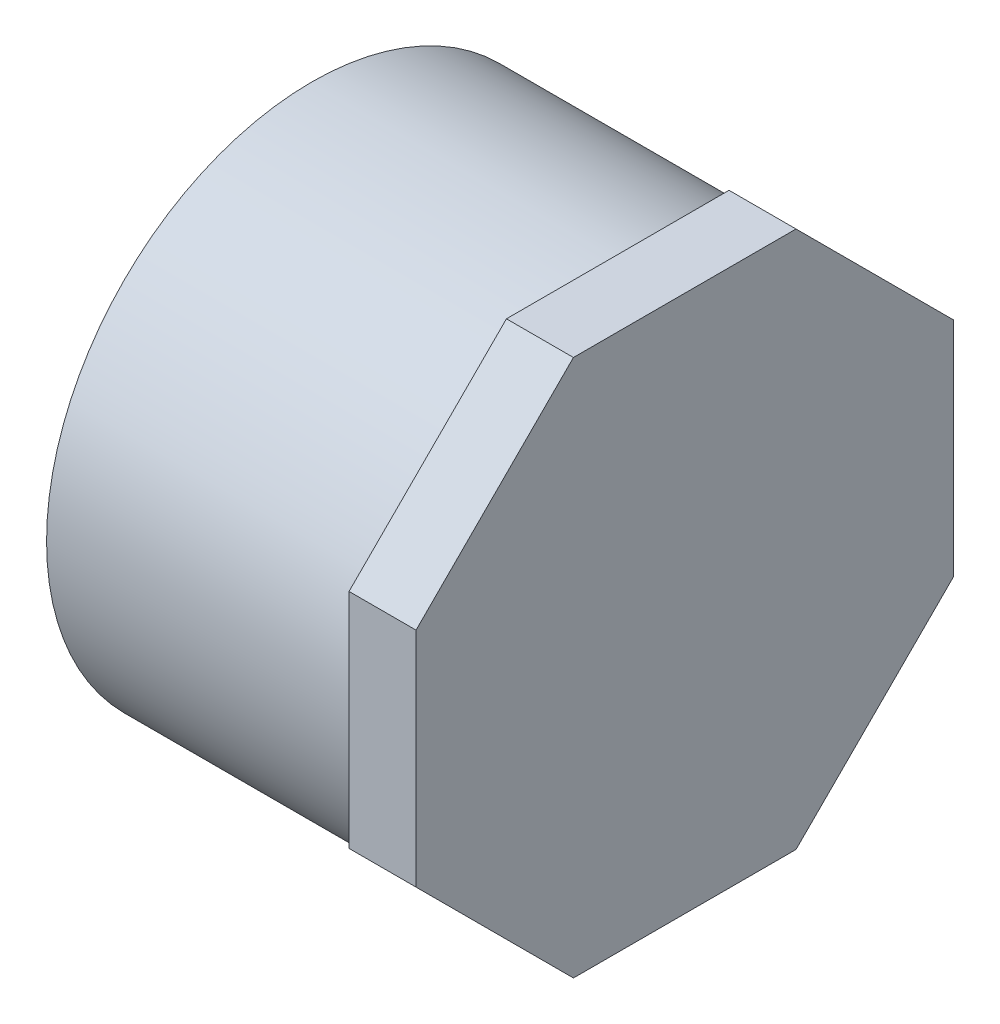
ISO-10303-21;
HEADER;
FILE_DESCRIPTION(('STEP AP214'),'2;1');
FILE_NAME('part.step','',(''),(''),'','','');
FILE_SCHEMA(('AUTOMOTIVE_DESIGN { 1 0 10303 214 1 1 1 1 }'));
ENDSEC;
DATA;
#1=APPLICATION_CONTEXT('core data for automotive mechanical design processes');
#2=APPLICATION_PROTOCOL_DEFINITION('international standard','automotive_design',2000,#1);
#3=PRODUCT_CONTEXT('',#1,'mechanical');
#4=PRODUCT('Part','Part','',(#3));
#5=PRODUCT_RELATED_PRODUCT_CATEGORY('part','',(#4));
#6=PRODUCT_DEFINITION_FORMATION('','',#4);
#7=PRODUCT_DEFINITION_CONTEXT('part definition',#1,'design');
#8=PRODUCT_DEFINITION('design','',#6,#7);
#9=PRODUCT_DEFINITION_SHAPE('','',#8);
#10=(LENGTH_UNIT() NAMED_UNIT(*) SI_UNIT(.MILLI.,.METRE.));
#11=(NAMED_UNIT(*) PLANE_ANGLE_UNIT() SI_UNIT($,.RADIAN.));
#12=(NAMED_UNIT(*) SI_UNIT($,.STERADIAN.) SOLID_ANGLE_UNIT());
#13=UNCERTAINTY_MEASURE_WITH_UNIT(LENGTH_MEASURE(1.E-05),#10,'distance_accuracy_value','');
#14=(GEOMETRIC_REPRESENTATION_CONTEXT(3) GLOBAL_UNCERTAINTY_ASSIGNED_CONTEXT((#13)) GLOBAL_UNIT_ASSIGNED_CONTEXT((#10,
#11,#12)) REPRESENTATION_CONTEXT('',''));
#15=CARTESIAN_POINT('',(0.,0.,0.));
#16=DIRECTION('',(0.,0.,1.));
#17=DIRECTION('',(1.,0.,0.));
#18=AXIS2_PLACEMENT_3D('',#15,#16,#17);
#19=CARTESIAN_POINT('',(-21.209,0.,0.));
#20=DIRECTION('',(-1.,0.,0.));
#21=DIRECTION('',(0.,0.,1.));
#22=AXIS2_PLACEMENT_3D('',#19,#20,#21);
#23=CYLINDRICAL_SURFACE('',#22,30.1625);
#24=CARTESIAN_POINT('',(-21.209,0.,0.));
#25=DIRECTION('',(-1.,0.,0.));
#26=DIRECTION('',(0.,0.,1.));
#27=AXIS2_PLACEMENT_3D('',#24,#25,#26);
#28=CIRCLE('',#27,30.1625);
#29=CARTESIAN_POINT('',(-21.209,0.,30.1625));
#30=VERTEX_POINT('',#29);
#31=EDGE_CURVE('E13',#30,#30,#28,.T.);
#32=ORIENTED_EDGE('',*,*,#31,.F.);
#33=EDGE_LOOP('',(#32));
#34=FACE_BOUND('',#33,.T.);
#35=CARTESIAN_POINT('',(13.589,0.,0.));
#36=DIRECTION('',(1.,0.,0.));
#37=DIRECTION('',(0.,0.,-1.));
#38=AXIS2_PLACEMENT_3D('',#35,#36,#37);
#39=CIRCLE('',#38,30.1625);
#40=CARTESIAN_POINT('',(13.589,0.,-30.1625));
#41=VERTEX_POINT('',#40);
#42=EDGE_CURVE('E150',#41,#41,#39,.T.);
#43=ORIENTED_EDGE('',*,*,#42,.F.);
#44=EDGE_LOOP('',(#43));
#45=FACE_BOUND('',#44,.T.);
#46=ADVANCED_FACE('F46',(#34,#45),#23,.T.);
#47=CARTESIAN_POINT('',(-21.209,-26.2509,0.));
#48=DIRECTION('',(-1.,0.,0.));
#49=DIRECTION('',(0.,0.,1.));
#50=AXIS2_PLACEMENT_3D('',#47,#48,#49);
#51=PLANE('',#50);
#52=ORIENTED_EDGE('',*,*,#31,.T.);
#53=EDGE_LOOP('',(#52));
#54=FACE_BOUND('',#53,.T.);
#55=CARTESIAN_POINT('',(-21.209,0.,0.));
#56=DIRECTION('',(-1.,0.,0.));
#57=DIRECTION('',(0.,0.,1.));
#58=AXIS2_PLACEMENT_3D('',#55,#56,#57);
#59=CIRCLE('',#58,26.2509);
#60=CARTESIAN_POINT('',(-21.209,0.,26.2509));
#61=VERTEX_POINT('',#60);
#62=EDGE_CURVE('E171',#61,#61,#59,.T.);
#63=ORIENTED_EDGE('',*,*,#62,.F.);
#64=EDGE_LOOP('',(#63));
#65=FACE_BOUND('',#64,.T.);
#66=ADVANCED_FACE('F48',(#54,#65),#51,.T.);
#67=CARTESIAN_POINT('',(13.589,0.,0.));
#68=DIRECTION('',(-1.,0.,0.));
#69=DIRECTION('',(0.,0.,1.));
#70=AXIS2_PLACEMENT_3D('',#67,#68,#69);
#71=PLANE('',#70);
#72=CARTESIAN_POINT('',(13.589,0.,0.));
#73=DIRECTION('',(-1.,0.,0.));
#74=DIRECTION('',(0.,0.,1.));
#75=AXIS2_PLACEMENT_3D('',#72,#73,#74);
#76=CIRCLE('',#75,26.2509);
#77=CARTESIAN_POINT('',(13.589,0.,26.2509));
#78=VERTEX_POINT('',#77);
#79=EDGE_CURVE('E55',#78,#78,#76,.T.);
#80=ORIENTED_EDGE('',*,*,#79,.T.);
#81=EDGE_LOOP('',(#80));
#82=FACE_BOUND('',#81,.T.);
#83=ADVANCED_FACE('F185',(#82),#71,.T.);
#84=CARTESIAN_POINT('',(-21.209,0.,0.));
#85=DIRECTION('',(-1.,0.,0.));
#86=DIRECTION('',(0.,0.,1.));
#87=AXIS2_PLACEMENT_3D('',#84,#85,#86);
#88=CYLINDRICAL_SURFACE('',#87,26.2509);
#89=ORIENTED_EDGE('',*,*,#62,.T.);
#90=EDGE_LOOP('',(#89));
#91=FACE_BOUND('',#90,.T.);
#92=ORIENTED_EDGE('',*,*,#79,.F.);
#93=EDGE_LOOP('',(#92));
#94=FACE_BOUND('',#93,.T.);
#95=ADVANCED_FACE('F187',(#91,#94),#88,.F.);
#96=CARTESIAN_POINT('',(13.589,30.5593750000001,-12.6581075826453));
#97=DIRECTION('',(0.,1.,0.));
#98=DIRECTION('',(0.,0.,1.));
#99=AXIS2_PLACEMENT_3D('',#96,#97,#98);
#100=PLANE('',#99);
#101=DIRECTION('',(0.,0.,1.));
#102=VECTOR('',#101,1.);
#103=CARTESIAN_POINT('',(21.209,30.5593750000001,-12.6581075826453));
#104=LINE('',#103,#102);
#105=CARTESIAN_POINT('',(21.209,30.5593750000001,-12.6581075826453));
#106=VERTEX_POINT('',#105);
#107=CARTESIAN_POINT('',(21.209,30.5593750000001,12.6581075826453));
#108=VERTEX_POINT('',#107);
#109=EDGE_CURVE('E146',#106,#108,#104,.T.);
#110=ORIENTED_EDGE('',*,*,#109,.F.);
#111=DIRECTION('',(1.,0.,0.));
#112=VECTOR('',#111,1.);
#113=CARTESIAN_POINT('',(13.589,30.5593750000001,-12.6581075826453));
#114=LINE('',#113,#112);
#115=CARTESIAN_POINT('',(13.589,30.5593750000001,-12.6581075826453));
#116=VERTEX_POINT('',#115);
#117=EDGE_CURVE('E63',#116,#106,#114,.T.);
#118=ORIENTED_EDGE('',*,*,#117,.F.);
#119=DIRECTION('',(0.,0.,1.));
#120=VECTOR('',#119,1.);
#121=CARTESIAN_POINT('',(13.589,30.5593750000001,-12.6581075826453));
#122=LINE('',#121,#120);
#123=CARTESIAN_POINT('',(13.589,30.5593750000001,12.6581075826453));
#124=VERTEX_POINT('',#123);
#125=EDGE_CURVE('E168',#116,#124,#122,.T.);
#126=ORIENTED_EDGE('',*,*,#125,.T.);
#127=DIRECTION('',(1.,0.,0.));
#128=VECTOR('',#127,1.);
#129=CARTESIAN_POINT('',(13.589,30.5593750000001,12.6581075826453));
#130=LINE('',#129,#128);
#131=EDGE_CURVE('E104',#124,#108,#130,.T.);
#132=ORIENTED_EDGE('',*,*,#131,.T.);
#133=EDGE_LOOP('',(#110,#118,#126,#132));
#134=FACE_BOUND('',#133,.T.);
#135=ADVANCED_FACE('F189',(#134),#100,.T.);
#136=CARTESIAN_POINT('',(13.589,12.6581075826453,-30.559375));
#137=DIRECTION('',(0.,0.707106781186548,-0.707106781186548));
#138=DIRECTION('',(0.,0.707106781186547,0.707106781186548));
#139=AXIS2_PLACEMENT_3D('',#136,#137,#138);
#140=PLANE('',#139);
#141=DIRECTION('',(0.,0.707106781186548,0.707106781186548));
#142=VECTOR('',#141,1.);
#143=CARTESIAN_POINT('',(21.209,12.6581075826453,-30.559375));
#144=LINE('',#143,#142);
#145=CARTESIAN_POINT('',(21.209,12.6581075826453,-30.559375));
#146=VERTEX_POINT('',#145);
#147=EDGE_CURVE('E165',#146,#106,#144,.T.);
#148=ORIENTED_EDGE('',*,*,#147,.F.);
#149=DIRECTION('',(1.,0.,0.));
#150=VECTOR('',#149,1.);
#151=CARTESIAN_POINT('',(13.589,12.6581075826453,-30.559375));
#152=LINE('',#151,#150);
#153=CARTESIAN_POINT('',(13.589,12.6581075826453,-30.559375));
#154=VERTEX_POINT('',#153);
#155=EDGE_CURVE('E92',#154,#146,#152,.T.);
#156=ORIENTED_EDGE('',*,*,#155,.F.);
#157=DIRECTION('',(0.,0.707106781186548,0.707106781186548));
#158=VECTOR('',#157,1.);
#159=CARTESIAN_POINT('',(13.589,12.6581075826453,-30.559375));
#160=LINE('',#159,#158);
#161=EDGE_CURVE('E136',#154,#116,#160,.T.);
#162=ORIENTED_EDGE('',*,*,#161,.T.);
#163=ORIENTED_EDGE('',*,*,#117,.T.);
#164=EDGE_LOOP('',(#148,#156,#162,#163));
#165=FACE_BOUND('',#164,.T.);
#166=ADVANCED_FACE('F196',(#165),#140,.T.);
#167=CARTESIAN_POINT('',(13.589,-12.6581075826453,-30.559375));
#168=DIRECTION('',(0.,0.,-1.));
#169=DIRECTION('',(-1.,0.,0.));
#170=AXIS2_PLACEMENT_3D('',#167,#168,#169);
#171=PLANE('',#170);
#172=DIRECTION('',(0.,1.,0.));
#173=VECTOR('',#172,1.);
#174=CARTESIAN_POINT('',(21.209,-12.6581075826453,-30.559375));
#175=LINE('',#174,#173);
#176=CARTESIAN_POINT('',(21.209,-12.6581075826453,-30.559375));
#177=VERTEX_POINT('',#176);
#178=EDGE_CURVE('E123',#177,#146,#175,.T.);
#179=ORIENTED_EDGE('',*,*,#178,.F.);
#180=DIRECTION('',(1.,0.,0.));
#181=VECTOR('',#180,1.);
#182=CARTESIAN_POINT('',(13.589,-12.6581075826453,-30.559375));
#183=LINE('',#182,#181);
#184=CARTESIAN_POINT('',(13.589,-12.6581075826453,-30.559375));
#185=VERTEX_POINT('',#184);
#186=EDGE_CURVE('E118',#185,#177,#183,.T.);
#187=ORIENTED_EDGE('',*,*,#186,.F.);
#188=DIRECTION('',(0.,1.,0.));
#189=VECTOR('',#188,1.);
#190=CARTESIAN_POINT('',(13.589,-12.6581075826453,-30.559375));
#191=LINE('',#190,#189);
#192=EDGE_CURVE('E121',#185,#154,#191,.T.);
#193=ORIENTED_EDGE('',*,*,#192,.T.);
#194=ORIENTED_EDGE('',*,*,#155,.T.);
#195=EDGE_LOOP('',(#179,#187,#193,#194));
#196=FACE_BOUND('',#195,.T.);
#197=ADVANCED_FACE('F120',(#196),#171,.T.);
#198=CARTESIAN_POINT('',(13.589,-30.5593749999999,-12.6581075826453));
#199=DIRECTION('',(0.,-0.707106781186548,-0.707106781186548));
#200=DIRECTION('',(0.,0.707106781186548,-0.707106781186548));
#201=AXIS2_PLACEMENT_3D('',#198,#199,#200);
#202=PLANE('',#201);
#203=DIRECTION('',(0.,0.707106781186548,-0.707106781186548));
#204=VECTOR('',#203,1.);
#205=CARTESIAN_POINT('',(21.209,-30.5593749999999,-12.6581075826453));
#206=LINE('',#205,#204);
#207=CARTESIAN_POINT('',(21.209,-30.5593749999999,-12.6581075826453));
#208=VERTEX_POINT('',#207);
#209=EDGE_CURVE('E162',#208,#177,#206,.T.);
#210=ORIENTED_EDGE('',*,*,#209,.F.);
#211=DIRECTION('',(1.,0.,0.));
#212=VECTOR('',#211,1.);
#213=CARTESIAN_POINT('',(13.589,-30.5593749999999,-12.6581075826453));
#214=LINE('',#213,#212);
#215=CARTESIAN_POINT('',(13.589,-30.5593749999999,-12.6581075826453));
#216=VERTEX_POINT('',#215);
#217=EDGE_CURVE('E128',#216,#208,#214,.T.);
#218=ORIENTED_EDGE('',*,*,#217,.F.);
#219=DIRECTION('',(0.,0.707106781186548,-0.707106781186548));
#220=VECTOR('',#219,1.);
#221=CARTESIAN_POINT('',(13.589,-30.5593749999999,-12.6581075826453));
#222=LINE('',#221,#220);
#223=EDGE_CURVE('E134',#216,#185,#222,.T.);
#224=ORIENTED_EDGE('',*,*,#223,.T.);
#225=ORIENTED_EDGE('',*,*,#186,.T.);
#226=EDGE_LOOP('',(#210,#218,#224,#225));
#227=FACE_BOUND('',#226,.T.);
#228=ADVANCED_FACE('F138',(#227),#202,.T.);
#229=CARTESIAN_POINT('',(13.589,-30.5593750000001,12.6581075826453));
#230=DIRECTION('',(0.,-1.,0.));
#231=DIRECTION('',(0.,0.,-1.));
#232=AXIS2_PLACEMENT_3D('',#229,#230,#231);
#233=PLANE('',#232);
#234=DIRECTION('',(0.,0.,-1.));
#235=VECTOR('',#234,1.);
#236=CARTESIAN_POINT('',(21.209,-30.5593750000001,12.6581075826453));
#237=LINE('',#236,#235);
#238=CARTESIAN_POINT('',(21.209,-30.5593750000001,12.6581075826453));
#239=VERTEX_POINT('',#238);
#240=EDGE_CURVE('E159',#239,#208,#237,.T.);
#241=ORIENTED_EDGE('',*,*,#240,.F.);
#242=DIRECTION('',(1.,0.,0.));
#243=VECTOR('',#242,1.);
#244=CARTESIAN_POINT('',(13.589,-30.5593750000001,12.6581075826453));
#245=LINE('',#244,#243);
#246=CARTESIAN_POINT('',(13.589,-30.5593750000001,12.6581075826453));
#247=VERTEX_POINT('',#246);
#248=EDGE_CURVE('E174',#247,#239,#245,.T.);
#249=ORIENTED_EDGE('',*,*,#248,.F.);
#250=DIRECTION('',(0.,0.,-1.));
#251=VECTOR('',#250,1.);
#252=CARTESIAN_POINT('',(13.589,-30.5593750000001,12.6581075826453));
#253=LINE('',#252,#251);
#254=EDGE_CURVE('E139',#247,#216,#253,.T.);
#255=ORIENTED_EDGE('',*,*,#254,.T.);
#256=ORIENTED_EDGE('',*,*,#217,.T.);
#257=EDGE_LOOP('',(#241,#249,#255,#256));
#258=FACE_BOUND('',#257,.T.);
#259=ADVANCED_FACE('F230',(#258),#233,.T.);
#260=CARTESIAN_POINT('',(13.589,-12.6581075826453,30.559375));
#261=DIRECTION('',(0.,-0.707106781186548,0.707106781186547));
#262=DIRECTION('',(0.,-0.707106781186547,-0.707106781186548));
#263=AXIS2_PLACEMENT_3D('',#260,#261,#262);
#264=PLANE('',#263);
#265=DIRECTION('',(0.,-0.707106781186547,-0.707106781186548));
#266=VECTOR('',#265,1.);
#267=CARTESIAN_POINT('',(21.209,-12.6581075826453,30.559375));
#268=LINE('',#267,#266);
#269=CARTESIAN_POINT('',(21.209,-12.6581075826453,30.559375));
#270=VERTEX_POINT('',#269);
#271=EDGE_CURVE('E156',#270,#239,#268,.T.);
#272=ORIENTED_EDGE('',*,*,#271,.F.);
#273=DIRECTION('',(1.,0.,0.));
#274=VECTOR('',#273,1.);
#275=CARTESIAN_POINT('',(13.589,-12.6581075826453,30.559375));
#276=LINE('',#275,#274);
#277=CARTESIAN_POINT('',(13.589,-12.6581075826453,30.559375));
#278=VERTEX_POINT('',#277);
#279=EDGE_CURVE('E176',#278,#270,#276,.T.);
#280=ORIENTED_EDGE('',*,*,#279,.F.);
#281=DIRECTION('',(0.,-0.707106781186547,-0.707106781186548));
#282=VECTOR('',#281,1.);
#283=CARTESIAN_POINT('',(13.589,-12.6581075826453,30.559375));
#284=LINE('',#283,#282);
#285=EDGE_CURVE('E141',#278,#247,#284,.T.);
#286=ORIENTED_EDGE('',*,*,#285,.T.);
#287=ORIENTED_EDGE('',*,*,#248,.T.);
#288=EDGE_LOOP('',(#272,#280,#286,#287));
#289=FACE_BOUND('',#288,.T.);
#290=ADVANCED_FACE('F226',(#289),#264,.T.);
#291=CARTESIAN_POINT('',(13.589,12.6581075826453,30.559375));
#292=DIRECTION('',(0.,0.,1.));
#293=DIRECTION('',(0.,-1.,0.));
#294=AXIS2_PLACEMENT_3D('',#291,#292,#293);
#295=PLANE('',#294);
#296=DIRECTION('',(0.,-1.,0.));
#297=VECTOR('',#296,1.);
#298=CARTESIAN_POINT('',(21.209,12.6581075826453,30.559375));
#299=LINE('',#298,#297);
#300=CARTESIAN_POINT('',(21.209,12.6581075826453,30.559375));
#301=VERTEX_POINT('',#300);
#302=EDGE_CURVE('E153',#301,#270,#299,.T.);
#303=ORIENTED_EDGE('',*,*,#302,.F.);
#304=DIRECTION('',(1.,0.,0.));
#305=VECTOR('',#304,1.);
#306=CARTESIAN_POINT('',(13.589,12.6581075826453,30.559375));
#307=LINE('',#306,#305);
#308=CARTESIAN_POINT('',(13.589,12.6581075826453,30.559375));
#309=VERTEX_POINT('',#308);
#310=EDGE_CURVE('E178',#309,#301,#307,.T.);
#311=ORIENTED_EDGE('',*,*,#310,.F.);
#312=DIRECTION('',(0.,-1.,0.));
#313=VECTOR('',#312,1.);
#314=CARTESIAN_POINT('',(13.589,12.6581075826453,30.559375));
#315=LINE('',#314,#313);
#316=EDGE_CURVE('E298',#309,#278,#315,.T.);
#317=ORIENTED_EDGE('',*,*,#316,.T.);
#318=ORIENTED_EDGE('',*,*,#279,.T.);
#319=EDGE_LOOP('',(#303,#311,#317,#318));
#320=FACE_BOUND('',#319,.T.);
#321=ADVANCED_FACE('F222',(#320),#295,.T.);
#322=CARTESIAN_POINT('',(13.589,30.5593750000001,12.6581075826453));
#323=DIRECTION('',(0.,0.707106781186547,0.707106781186548));
#324=DIRECTION('',(0.,-0.707106781186548,0.707106781186547));
#325=AXIS2_PLACEMENT_3D('',#322,#323,#324);
#326=PLANE('',#325);
#327=DIRECTION('',(0.,-0.707106781186548,0.707106781186547));
#328=VECTOR('',#327,1.);
#329=CARTESIAN_POINT('',(21.209,30.5593750000001,12.6581075826453));
#330=LINE('',#329,#328);
#331=EDGE_CURVE('E149',#108,#301,#330,.T.);
#332=ORIENTED_EDGE('',*,*,#331,.F.);
#333=ORIENTED_EDGE('',*,*,#131,.F.);
#334=DIRECTION('',(0.,-0.707106781186548,0.707106781186547));
#335=VECTOR('',#334,1.);
#336=CARTESIAN_POINT('',(13.589,30.5593750000001,12.6581075826453));
#337=LINE('',#336,#335);
#338=EDGE_CURVE('E218',#124,#309,#337,.T.);
#339=ORIENTED_EDGE('',*,*,#338,.T.);
#340=ORIENTED_EDGE('',*,*,#310,.T.);
#341=EDGE_LOOP('',(#332,#333,#339,#340));
#342=FACE_BOUND('',#341,.T.);
#343=ADVANCED_FACE('F214',(#342),#326,.T.);
#344=CARTESIAN_POINT('',(13.589,30.5593750000001,30.559375));
#345=DIRECTION('',(1.,0.,0.));
#346=DIRECTION('',(0.,0.,-1.));
#347=AXIS2_PLACEMENT_3D('',#344,#345,#346);
#348=PLANE('',#347);
#349=ORIENTED_EDGE('',*,*,#42,.T.);
#350=EDGE_LOOP('',(#349));
#351=FACE_BOUND('',#350,.T.);
#352=ORIENTED_EDGE('',*,*,#125,.F.);
#353=ORIENTED_EDGE('',*,*,#161,.F.);
#354=ORIENTED_EDGE('',*,*,#192,.F.);
#355=ORIENTED_EDGE('',*,*,#223,.F.);
#356=ORIENTED_EDGE('',*,*,#254,.F.);
#357=ORIENTED_EDGE('',*,*,#285,.F.);
#358=ORIENTED_EDGE('',*,*,#316,.F.);
#359=ORIENTED_EDGE('',*,*,#338,.F.);
#360=EDGE_LOOP('',(#352,#353,#354,#355,#356,#357,#358,#359));
#361=FACE_BOUND('',#360,.T.);
#362=ADVANCED_FACE('F132',(#351,#361),#348,.F.);
#363=CARTESIAN_POINT('',(21.209,0.,0.));
#364=DIRECTION('',(1.,0.,0.));
#365=DIRECTION('',(0.,0.,-1.));
#366=AXIS2_PLACEMENT_3D('',#363,#364,#365);
#367=PLANE('',#366);
#368=ORIENTED_EDGE('',*,*,#109,.T.);
#369=ORIENTED_EDGE('',*,*,#331,.T.);
#370=ORIENTED_EDGE('',*,*,#302,.T.);
#371=ORIENTED_EDGE('',*,*,#271,.T.);
#372=ORIENTED_EDGE('',*,*,#240,.T.);
#373=ORIENTED_EDGE('',*,*,#209,.T.);
#374=ORIENTED_EDGE('',*,*,#178,.T.);
#375=ORIENTED_EDGE('',*,*,#147,.T.);
#376=EDGE_LOOP('',(#368,#369,#370,#371,#372,#373,#374,#375));
#377=FACE_BOUND('',#376,.T.);
#378=ADVANCED_FACE('F208',(#377),#367,.T.);
#379=CLOSED_SHELL('',(#46,#66,#83,#95,#135,#166,#197,#228,#259,#290,#321,#343,#362,#378));
#380=MANIFOLD_SOLID_BREP('B2',#379);
#381=ADVANCED_BREP_SHAPE_REPRESENTATION('',(#18,#380),#14);
#382=SHAPE_DEFINITION_REPRESENTATION(#9,#381);
ENDSEC;
END-ISO-10303-21;
